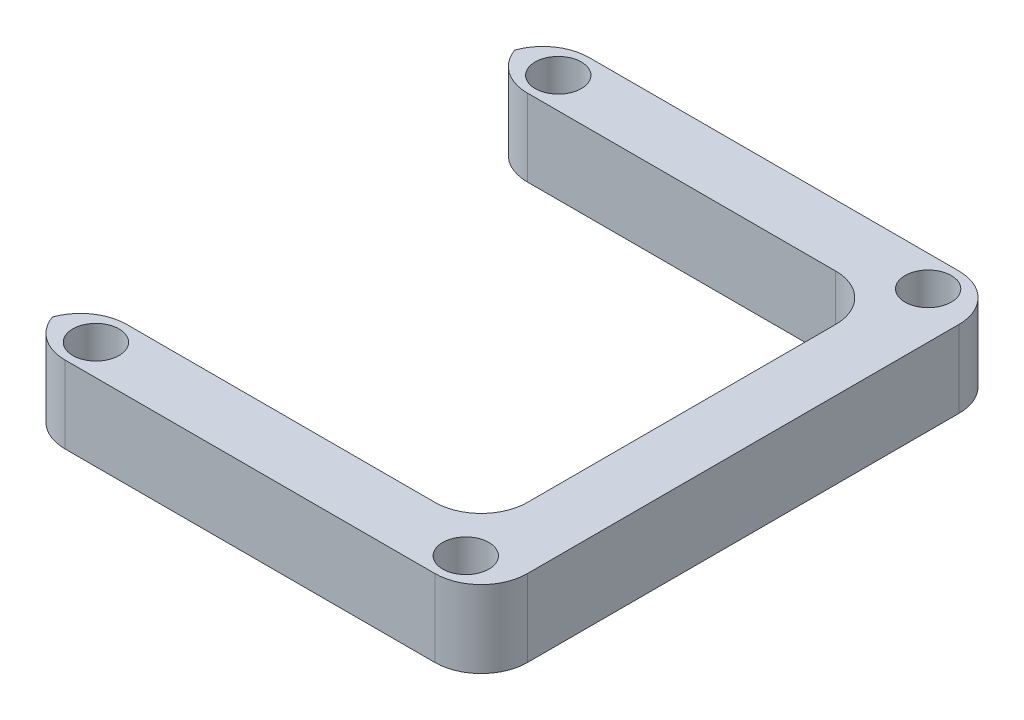
ISO-10303-21;
HEADER;
FILE_DESCRIPTION(('STEP AP214'),'2;1');
FILE_NAME('part.step','',(''),(''),'','','');
FILE_SCHEMA(('AUTOMOTIVE_DESIGN { 1 0 10303 214 1 1 1 1 }'));
ENDSEC;
DATA;
#1=APPLICATION_CONTEXT('core data for automotive mechanical design processes');
#2=APPLICATION_PROTOCOL_DEFINITION('international standard','automotive_design',2000,#1);
#3=PRODUCT_CONTEXT('',#1,'mechanical');
#4=PRODUCT('Part','Part','',(#3));
#5=PRODUCT_RELATED_PRODUCT_CATEGORY('part','',(#4));
#6=PRODUCT_DEFINITION_FORMATION('','',#4);
#7=PRODUCT_DEFINITION_CONTEXT('part definition',#1,'design');
#8=PRODUCT_DEFINITION('design','',#6,#7);
#9=PRODUCT_DEFINITION_SHAPE('','',#8);
#10=(LENGTH_UNIT() NAMED_UNIT(*) SI_UNIT(.MILLI.,.METRE.));
#11=(NAMED_UNIT(*) PLANE_ANGLE_UNIT() SI_UNIT($,.RADIAN.));
#12=(NAMED_UNIT(*) SI_UNIT($,.STERADIAN.) SOLID_ANGLE_UNIT());
#13=UNCERTAINTY_MEASURE_WITH_UNIT(LENGTH_MEASURE(1.E-05),#10,'distance_accuracy_value','');
#14=(GEOMETRIC_REPRESENTATION_CONTEXT(3) GLOBAL_UNCERTAINTY_ASSIGNED_CONTEXT((#13)) GLOBAL_UNIT_ASSIGNED_CONTEXT((#10,
#11,#12)) REPRESENTATION_CONTEXT('',''));
#15=CARTESIAN_POINT('',(0.,0.,0.));
#16=DIRECTION('',(0.,0.,1.));
#17=DIRECTION('',(1.,0.,0.));
#18=AXIS2_PLACEMENT_3D('',#15,#16,#17);
#19=CARTESIAN_POINT('',(0.,5.,-30.));
#20=DIRECTION('',(0.,0.,1.));
#21=DIRECTION('',(1.,0.,0.));
#22=AXIS2_PLACEMENT_3D('',#19,#20,#21);
#23=PLANE('',#22);
#24=DIRECTION('',(-1.,0.,0.));
#25=VECTOR('',#24,1.);
#26=CARTESIAN_POINT('',(0.,5.,-30.));
#27=LINE('',#26,#25);
#28=CARTESIAN_POINT('',(23.,5.,-30.));
#29=VERTEX_POINT('',#28);
#30=CARTESIAN_POINT('',(3.,5.,-30.));
#31=VERTEX_POINT('',#30);
#32=EDGE_CURVE('E347',#29,#31,#27,.T.);
#33=ORIENTED_EDGE('',*,*,#32,.T.);
#34=DIRECTION('',(0.,-1.,0.));
#35=VECTOR('',#34,1.);
#36=CARTESIAN_POINT('',(3.,5.,-30.));
#37=LINE('',#36,#35);
#38=CARTESIAN_POINT('',(3.,0.,-30.));
#39=VERTEX_POINT('',#38);
#40=EDGE_CURVE('E217',#31,#39,#37,.T.);
#41=ORIENTED_EDGE('',*,*,#40,.T.);
#42=DIRECTION('',(-1.,0.,0.));
#43=VECTOR('',#42,1.);
#44=CARTESIAN_POINT('',(0.,0.,-30.));
#45=LINE('',#44,#43);
#46=CARTESIAN_POINT('',(23.,0.,-30.));
#47=VERTEX_POINT('',#46);
#48=EDGE_CURVE('E299',#47,#39,#45,.T.);
#49=ORIENTED_EDGE('',*,*,#48,.F.);
#50=DIRECTION('',(0.,-1.,0.));
#51=VECTOR('',#50,1.);
#52=CARTESIAN_POINT('',(23.,5.,-30.));
#53=LINE('',#52,#51);
#54=EDGE_CURVE('E214',#47,#29,#53,.F.);
#55=ORIENTED_EDGE('',*,*,#54,.T.);
#56=EDGE_LOOP('',(#33,#41,#49,#55));
#57=FACE_BOUND('',#56,.T.);
#58=ADVANCED_FACE('F39',(#57),#23,.T.);
#59=CARTESIAN_POINT('',(26.,5.,0.));
#60=DIRECTION('',(-1.,0.,0.));
#61=DIRECTION('',(0.,0.,1.));
#62=AXIS2_PLACEMENT_3D('',#59,#60,#61);
#63=PLANE('',#62);
#64=DIRECTION('',(0.,0.,-1.));
#65=VECTOR('',#64,1.);
#66=CARTESIAN_POINT('',(26.,5.,0.));
#67=LINE('',#66,#65);
#68=CARTESIAN_POINT('',(26.,5.,-7.));
#69=VERTEX_POINT('',#68);
#70=CARTESIAN_POINT('',(26.,5.,-27.));
#71=VERTEX_POINT('',#70);
#72=EDGE_CURVE('E284',#69,#71,#67,.T.);
#73=ORIENTED_EDGE('',*,*,#72,.T.);
#74=DIRECTION('',(0.,-1.,0.));
#75=VECTOR('',#74,1.);
#76=CARTESIAN_POINT('',(26.,0.,-27.));
#77=LINE('',#76,#75);
#78=CARTESIAN_POINT('',(26.,0.,-27.));
#79=VERTEX_POINT('',#78);
#80=EDGE_CURVE('E223',#71,#79,#77,.T.);
#81=ORIENTED_EDGE('',*,*,#80,.T.);
#82=DIRECTION('',(0.,0.,-1.));
#83=VECTOR('',#82,1.);
#84=CARTESIAN_POINT('',(26.,0.,0.));
#85=LINE('',#84,#83);
#86=CARTESIAN_POINT('',(26.,0.,-7.));
#87=VERTEX_POINT('',#86);
#88=EDGE_CURVE('E302',#87,#79,#85,.T.);
#89=ORIENTED_EDGE('',*,*,#88,.F.);
#90=DIRECTION('',(0.,-1.,0.));
#91=VECTOR('',#90,1.);
#92=CARTESIAN_POINT('',(26.,5.,-7.));
#93=LINE('',#92,#91);
#94=EDGE_CURVE('E220',#87,#69,#93,.F.);
#95=ORIENTED_EDGE('',*,*,#94,.T.);
#96=EDGE_LOOP('',(#73,#81,#89,#95));
#97=FACE_BOUND('',#96,.T.);
#98=ADVANCED_FACE('F335',(#97),#63,.T.);
#99=CARTESIAN_POINT('',(0.,5.,-4.));
#100=DIRECTION('',(0.,0.,-1.));
#101=DIRECTION('',(-1.,0.,0.));
#102=AXIS2_PLACEMENT_3D('',#99,#100,#101);
#103=PLANE('',#102);
#104=DIRECTION('',(1.,0.,0.));
#105=VECTOR('',#104,1.);
#106=CARTESIAN_POINT('',(0.,5.,-4.));
#107=LINE('',#106,#105);
#108=CARTESIAN_POINT('',(3.,5.,-4.));
#109=VERTEX_POINT('',#108);
#110=CARTESIAN_POINT('',(23.,5.,-4.));
#111=VERTEX_POINT('',#110);
#112=EDGE_CURVE('E278',#109,#111,#107,.T.);
#113=ORIENTED_EDGE('',*,*,#112,.T.);
#114=DIRECTION('',(0.,-1.,0.));
#115=VECTOR('',#114,1.);
#116=CARTESIAN_POINT('',(23.,0.,-4.));
#117=LINE('',#116,#115);
#118=CARTESIAN_POINT('',(23.,0.,-4.));
#119=VERTEX_POINT('',#118);
#120=EDGE_CURVE('E231',#111,#119,#117,.T.);
#121=ORIENTED_EDGE('',*,*,#120,.T.);
#122=DIRECTION('',(1.,0.,0.));
#123=VECTOR('',#122,1.);
#124=CARTESIAN_POINT('',(0.,0.,-4.));
#125=LINE('',#124,#123);
#126=CARTESIAN_POINT('',(3.,0.,-4.));
#127=VERTEX_POINT('',#126);
#128=EDGE_CURVE('E306',#127,#119,#125,.T.);
#129=ORIENTED_EDGE('',*,*,#128,.F.);
#130=DIRECTION('',(0.,-1.,0.));
#131=VECTOR('',#130,1.);
#132=CARTESIAN_POINT('',(3.,5.,-4.));
#133=LINE('',#132,#131);
#134=EDGE_CURVE('E227',#127,#109,#133,.F.);
#135=ORIENTED_EDGE('',*,*,#134,.T.);
#136=EDGE_LOOP('',(#113,#121,#129,#135));
#137=FACE_BOUND('',#136,.T.);
#138=ADVANCED_FACE('F326',(#137),#103,.T.);
#139=CARTESIAN_POINT('',(0.,5.,0.));
#140=DIRECTION('',(0.,0.,-1.));
#141=DIRECTION('',(-1.,0.,0.));
#142=AXIS2_PLACEMENT_3D('',#139,#140,#141);
#143=PLANE('',#142);
#144=DIRECTION('',(1.,0.,0.));
#145=VECTOR('',#144,1.);
#146=CARTESIAN_POINT('',(0.,5.,0.));
#147=LINE('',#146,#145);
#148=CARTESIAN_POINT('',(3.,5.,0.));
#149=VERTEX_POINT('',#148);
#150=CARTESIAN_POINT('',(27.,5.,0.));
#151=VERTEX_POINT('',#150);
#152=EDGE_CURVE('E270',#149,#151,#147,.T.);
#153=ORIENTED_EDGE('',*,*,#152,.F.);
#154=DIRECTION('',(0.,-1.,0.));
#155=VECTOR('',#154,1.);
#156=CARTESIAN_POINT('',(3.,0.,0.));
#157=LINE('',#156,#155);
#158=CARTESIAN_POINT('',(3.,0.,0.));
#159=VERTEX_POINT('',#158);
#160=EDGE_CURVE('E238',#149,#159,#157,.T.);
#161=ORIENTED_EDGE('',*,*,#160,.T.);
#162=DIRECTION('',(1.,0.,0.));
#163=VECTOR('',#162,1.);
#164=CARTESIAN_POINT('',(0.,0.,0.));
#165=LINE('',#164,#163);
#166=CARTESIAN_POINT('',(27.,0.,0.));
#167=VERTEX_POINT('',#166);
#168=EDGE_CURVE('E310',#159,#167,#165,.T.);
#169=ORIENTED_EDGE('',*,*,#168,.T.);
#170=DIRECTION('',(0.,-1.,0.));
#171=VECTOR('',#170,1.);
#172=CARTESIAN_POINT('',(27.,5.,0.));
#173=LINE('',#172,#171);
#174=EDGE_CURVE('E235',#167,#151,#173,.F.);
#175=ORIENTED_EDGE('',*,*,#174,.T.);
#176=EDGE_LOOP('',(#153,#161,#169,#175));
#177=FACE_BOUND('',#176,.T.);
#178=ADVANCED_FACE('F273',(#177),#143,.F.);
#179=CARTESIAN_POINT('',(30.,5.,0.));
#180=DIRECTION('',(-1.,0.,0.));
#181=DIRECTION('',(0.,0.,1.));
#182=AXIS2_PLACEMENT_3D('',#179,#180,#181);
#183=PLANE('',#182);
#184=DIRECTION('',(0.,0.,-1.));
#185=VECTOR('',#184,1.);
#186=CARTESIAN_POINT('',(30.,0.,0.));
#187=LINE('',#186,#185);
#188=CARTESIAN_POINT('',(30.,0.,-3.));
#189=VERTEX_POINT('',#188);
#190=CARTESIAN_POINT('',(30.,0.,-31.));
#191=VERTEX_POINT('',#190);
#192=EDGE_CURVE('E165',#189,#191,#187,.T.);
#193=ORIENTED_EDGE('',*,*,#192,.T.);
#194=DIRECTION('',(0.,-1.,0.));
#195=VECTOR('',#194,1.);
#196=CARTESIAN_POINT('',(30.,5.,-31.));
#197=LINE('',#196,#195);
#198=CARTESIAN_POINT('',(30.,5.,-31.));
#199=VERTEX_POINT('',#198);
#200=EDGE_CURVE('E195',#191,#199,#197,.F.);
#201=ORIENTED_EDGE('',*,*,#200,.T.);
#202=DIRECTION('',(0.,0.,-1.));
#203=VECTOR('',#202,1.);
#204=CARTESIAN_POINT('',(30.,5.,0.));
#205=LINE('',#204,#203);
#206=CARTESIAN_POINT('',(30.,5.,-3.));
#207=VERTEX_POINT('',#206);
#208=EDGE_CURVE('E175',#207,#199,#205,.T.);
#209=ORIENTED_EDGE('',*,*,#208,.F.);
#210=DIRECTION('',(0.,-1.,0.));
#211=VECTOR('',#210,1.);
#212=CARTESIAN_POINT('',(30.,5.,-3.));
#213=LINE('',#212,#211);
#214=EDGE_CURVE('E191',#207,#189,#213,.T.);
#215=ORIENTED_EDGE('',*,*,#214,.T.);
#216=EDGE_LOOP('',(#193,#201,#209,#215));
#217=FACE_BOUND('',#216,.T.);
#218=ADVANCED_FACE('F317',(#217),#183,.F.);
#219=CARTESIAN_POINT('',(3.,5.,-2.));
#220=DIRECTION('',(0.,-1.,0.));
#221=DIRECTION('',(0.,0.,-1.));
#222=AXIS2_PLACEMENT_3D('',#219,#220,#221);
#223=CYLINDRICAL_SURFACE('',#222,1.5);
#224=CARTESIAN_POINT('',(3.,5.,-2.));
#225=DIRECTION('',(0.,1.,0.));
#226=DIRECTION('',(0.,0.,1.));
#227=AXIS2_PLACEMENT_3D('',#224,#225,#226);
#228=CIRCLE('',#227,1.5);
#229=CARTESIAN_POINT('',(3.,5.,-0.5));
#230=VERTEX_POINT('',#229);
#231=EDGE_CURVE('E351',#230,#230,#228,.T.);
#232=ORIENTED_EDGE('',*,*,#231,.T.);
#233=EDGE_LOOP('',(#232));
#234=FACE_BOUND('',#233,.T.);
#235=CARTESIAN_POINT('',(3.,0.,-2.));
#236=DIRECTION('',(0.,1.,0.));
#237=DIRECTION('',(0.,0.,1.));
#238=AXIS2_PLACEMENT_3D('',#235,#236,#237);
#239=CIRCLE('',#238,1.5);
#240=CARTESIAN_POINT('',(3.,0.,-0.5));
#241=VERTEX_POINT('',#240);
#242=EDGE_CURVE('E295',#241,#241,#239,.T.);
#243=ORIENTED_EDGE('',*,*,#242,.F.);
#244=EDGE_LOOP('',(#243));
#245=FACE_BOUND('',#244,.T.);
#246=ADVANCED_FACE('F382',(#234,#245),#223,.F.);
#247=CARTESIAN_POINT('',(3.,5.,-32.));
#248=DIRECTION('',(0.,-1.,0.));
#249=DIRECTION('',(0.,0.,-1.));
#250=AXIS2_PLACEMENT_3D('',#247,#248,#249);
#251=CYLINDRICAL_SURFACE('',#250,1.5);
#252=CARTESIAN_POINT('',(3.,5.,-32.));
#253=DIRECTION('',(0.,1.,0.));
#254=DIRECTION('',(0.,0.,1.));
#255=AXIS2_PLACEMENT_3D('',#252,#253,#254);
#256=CIRCLE('',#255,1.5);
#257=CARTESIAN_POINT('',(3.,5.,-30.5));
#258=VERTEX_POINT('',#257);
#259=EDGE_CURVE('E356',#258,#258,#256,.T.);
#260=ORIENTED_EDGE('',*,*,#259,.T.);
#261=EDGE_LOOP('',(#260));
#262=FACE_BOUND('',#261,.T.);
#263=CARTESIAN_POINT('',(3.,0.,-32.));
#264=DIRECTION('',(0.,1.,0.));
#265=DIRECTION('',(0.,0.,1.));
#266=AXIS2_PLACEMENT_3D('',#263,#264,#265);
#267=CIRCLE('',#266,1.5);
#268=CARTESIAN_POINT('',(3.,0.,-30.5));
#269=VERTEX_POINT('',#268);
#270=EDGE_CURVE('E291',#269,#269,#267,.T.);
#271=ORIENTED_EDGE('',*,*,#270,.F.);
#272=EDGE_LOOP('',(#271));
#273=FACE_BOUND('',#272,.T.);
#274=ADVANCED_FACE('F385',(#262,#273),#251,.F.);
#275=CARTESIAN_POINT('',(27.,5.,-32.));
#276=DIRECTION('',(0.,-1.,0.));
#277=DIRECTION('',(0.,0.,-1.));
#278=AXIS2_PLACEMENT_3D('',#275,#276,#277);
#279=CYLINDRICAL_SURFACE('',#278,1.5);
#280=CARTESIAN_POINT('',(27.,5.,-32.));
#281=DIRECTION('',(0.,1.,0.));
#282=DIRECTION('',(0.,0.,1.));
#283=AXIS2_PLACEMENT_3D('',#280,#281,#282);
#284=CIRCLE('',#283,1.5);
#285=CARTESIAN_POINT('',(27.,5.,-30.5));
#286=VERTEX_POINT('',#285);
#287=EDGE_CURVE('E362',#286,#286,#284,.T.);
#288=ORIENTED_EDGE('',*,*,#287,.T.);
#289=EDGE_LOOP('',(#288));
#290=FACE_BOUND('',#289,.T.);
#291=CARTESIAN_POINT('',(27.,0.,-32.));
#292=DIRECTION('',(0.,1.,0.));
#293=DIRECTION('',(0.,0.,1.));
#294=AXIS2_PLACEMENT_3D('',#291,#292,#293);
#295=CIRCLE('',#294,1.5);
#296=CARTESIAN_POINT('',(27.,0.,-30.5));
#297=VERTEX_POINT('',#296);
#298=EDGE_CURVE('E254',#297,#297,#295,.T.);
#299=ORIENTED_EDGE('',*,*,#298,.F.);
#300=EDGE_LOOP('',(#299));
#301=FACE_BOUND('',#300,.T.);
#302=ADVANCED_FACE('F408',(#290,#301),#279,.F.);
#303=CARTESIAN_POINT('',(27.,5.,-2.));
#304=DIRECTION('',(0.,-1.,0.));
#305=DIRECTION('',(0.,0.,-1.));
#306=AXIS2_PLACEMENT_3D('',#303,#304,#305);
#307=CYLINDRICAL_SURFACE('',#306,1.5);
#308=CARTESIAN_POINT('',(27.,5.,-2.));
#309=DIRECTION('',(0.,1.,0.));
#310=DIRECTION('',(0.,0.,1.));
#311=AXIS2_PLACEMENT_3D('',#308,#309,#310);
#312=CIRCLE('',#311,1.5);
#313=CARTESIAN_POINT('',(27.,5.,-0.499999999999999));
#314=VERTEX_POINT('',#313);
#315=EDGE_CURVE('E164',#314,#314,#312,.T.);
#316=ORIENTED_EDGE('',*,*,#315,.T.);
#317=EDGE_LOOP('',(#316));
#318=FACE_BOUND('',#317,.T.);
#319=CARTESIAN_POINT('',(27.,0.,-2.));
#320=DIRECTION('',(0.,1.,0.));
#321=DIRECTION('',(0.,0.,1.));
#322=AXIS2_PLACEMENT_3D('',#319,#320,#321);
#323=CIRCLE('',#322,1.5);
#324=CARTESIAN_POINT('',(27.,0.,-0.499999999999999));
#325=VERTEX_POINT('',#324);
#326=EDGE_CURVE('E250',#325,#325,#323,.T.);
#327=ORIENTED_EDGE('',*,*,#326,.F.);
#328=EDGE_LOOP('',(#327));
#329=FACE_BOUND('',#328,.T.);
#330=ADVANCED_FACE('F370',(#318,#329),#307,.F.);
#331=CARTESIAN_POINT('',(0.,5.,-34.));
#332=DIRECTION('',(0.,0.,-1.));
#333=DIRECTION('',(-1.,0.,0.));
#334=AXIS2_PLACEMENT_3D('',#331,#332,#333);
#335=PLANE('',#334);
#336=DIRECTION('',(1.,0.,0.));
#337=VECTOR('',#336,1.);
#338=CARTESIAN_POINT('',(0.,5.,-34.));
#339=LINE('',#338,#337);
#340=CARTESIAN_POINT('',(3.,5.,-34.));
#341=VERTEX_POINT('',#340);
#342=CARTESIAN_POINT('',(27.,5.,-34.));
#343=VERTEX_POINT('',#342);
#344=EDGE_CURVE('E169',#341,#343,#339,.T.);
#345=ORIENTED_EDGE('',*,*,#344,.T.);
#346=DIRECTION('',(0.,-1.,0.));
#347=VECTOR('',#346,1.);
#348=CARTESIAN_POINT('',(27.,0.,-34.));
#349=LINE('',#348,#347);
#350=CARTESIAN_POINT('',(27.,0.,-34.));
#351=VERTEX_POINT('',#350);
#352=EDGE_CURVE('E162',#343,#351,#349,.T.);
#353=ORIENTED_EDGE('',*,*,#352,.T.);
#354=DIRECTION('',(1.,0.,0.));
#355=VECTOR('',#354,1.);
#356=CARTESIAN_POINT('',(0.,0.,-34.));
#357=LINE('',#356,#355);
#358=CARTESIAN_POINT('',(3.,0.,-34.));
#359=VERTEX_POINT('',#358);
#360=EDGE_CURVE('E144',#359,#351,#357,.T.);
#361=ORIENTED_EDGE('',*,*,#360,.F.);
#362=DIRECTION('',(0.,-1.,0.));
#363=VECTOR('',#362,1.);
#364=CARTESIAN_POINT('',(3.,5.,-34.));
#365=LINE('',#364,#363);
#366=EDGE_CURVE('E160',#359,#341,#365,.F.);
#367=ORIENTED_EDGE('',*,*,#366,.T.);
#368=EDGE_LOOP('',(#345,#353,#361,#367));
#369=FACE_BOUND('',#368,.T.);
#370=ADVANCED_FACE('F159',(#369),#335,.T.);
#371=CARTESIAN_POINT('',(0.,5.,0.));
#372=DIRECTION('',(0.,1.,0.));
#373=DIRECTION('',(0.,0.,1.));
#374=AXIS2_PLACEMENT_3D('',#371,#372,#373);
#375=PLANE('',#374);
#376=ORIENTED_EDGE('',*,*,#315,.F.);
#377=EDGE_LOOP('',(#376));
#378=FACE_BOUND('',#377,.T.);
#379=ORIENTED_EDGE('',*,*,#287,.F.);
#380=EDGE_LOOP('',(#379));
#381=FACE_BOUND('',#380,.T.);
#382=ORIENTED_EDGE('',*,*,#259,.F.);
#383=EDGE_LOOP('',(#382));
#384=FACE_BOUND('',#383,.T.);
#385=ORIENTED_EDGE('',*,*,#231,.F.);
#386=EDGE_LOOP('',(#385));
#387=FACE_BOUND('',#386,.T.);
#388=ORIENTED_EDGE('',*,*,#208,.T.);
#389=CARTESIAN_POINT('',(27.,5.,-31.));
#390=DIRECTION('',(0.,1.,0.));
#391=DIRECTION('',(0.,0.,1.));
#392=AXIS2_PLACEMENT_3D('',#389,#390,#391);
#393=CIRCLE('',#392,3.);
#394=EDGE_CURVE('E211',#199,#343,#393,.T.);
#395=ORIENTED_EDGE('',*,*,#394,.T.);
#396=ORIENTED_EDGE('',*,*,#344,.F.);
#397=CARTESIAN_POINT('',(3.,5.,-31.));
#398=DIRECTION('',(0.,1.,0.));
#399=DIRECTION('',(0.,0.,1.));
#400=AXIS2_PLACEMENT_3D('',#397,#398,#399);
#401=CIRCLE('',#400,3.);
#402=CARTESIAN_POINT('',(0.171572875253809,5.,-32.));
#403=VERTEX_POINT('',#402);
#404=EDGE_CURVE('E57',#341,#403,#401,.T.);
#405=ORIENTED_EDGE('',*,*,#404,.T.);
#406=CARTESIAN_POINT('',(3.,5.,-33.));
#407=DIRECTION('',(0.,1.,0.));
#408=DIRECTION('',(0.,0.,1.));
#409=AXIS2_PLACEMENT_3D('',#406,#407,#408);
#410=CIRCLE('',#409,3.);
#411=EDGE_CURVE('E206',#403,#31,#410,.T.);
#412=ORIENTED_EDGE('',*,*,#411,.T.);
#413=ORIENTED_EDGE('',*,*,#32,.F.);
#414=CARTESIAN_POINT('',(23.,5.,-27.));
#415=DIRECTION('',(0.,1.,0.));
#416=DIRECTION('',(0.,0.,1.));
#417=AXIS2_PLACEMENT_3D('',#414,#415,#416);
#418=CIRCLE('',#417,3.);
#419=EDGE_CURVE('E244',#29,#71,#418,.F.);
#420=ORIENTED_EDGE('',*,*,#419,.T.);
#421=ORIENTED_EDGE('',*,*,#72,.F.);
#422=CARTESIAN_POINT('',(23.,5.,-7.));
#423=DIRECTION('',(0.,1.,0.));
#424=DIRECTION('',(0.,0.,1.));
#425=AXIS2_PLACEMENT_3D('',#422,#423,#424);
#426=CIRCLE('',#425,3.);
#427=EDGE_CURVE('E11',#69,#111,#426,.F.);
#428=ORIENTED_EDGE('',*,*,#427,.T.);
#429=ORIENTED_EDGE('',*,*,#112,.F.);
#430=CARTESIAN_POINT('',(3.,5.,-1.));
#431=DIRECTION('',(0.,1.,0.));
#432=DIRECTION('',(0.,0.,1.));
#433=AXIS2_PLACEMENT_3D('',#430,#431,#432);
#434=CIRCLE('',#433,3.);
#435=CARTESIAN_POINT('',(0.17157287525381,5.,-2.));
#436=VERTEX_POINT('',#435);
#437=EDGE_CURVE('E64',#109,#436,#434,.T.);
#438=ORIENTED_EDGE('',*,*,#437,.T.);
#439=CARTESIAN_POINT('',(3.,5.,-3.));
#440=DIRECTION('',(0.,1.,0.));
#441=DIRECTION('',(0.,0.,1.));
#442=AXIS2_PLACEMENT_3D('',#439,#440,#441);
#443=CIRCLE('',#442,3.);
#444=EDGE_CURVE('E201',#436,#149,#443,.T.);
#445=ORIENTED_EDGE('',*,*,#444,.T.);
#446=ORIENTED_EDGE('',*,*,#152,.T.);
#447=CARTESIAN_POINT('',(27.,5.,-3.));
#448=DIRECTION('',(0.,1.,0.));
#449=DIRECTION('',(0.,0.,1.));
#450=AXIS2_PLACEMENT_3D('',#447,#448,#449);
#451=CIRCLE('',#450,3.);
#452=EDGE_CURVE('E198',#151,#207,#451,.T.);
#453=ORIENTED_EDGE('',*,*,#452,.T.);
#454=EDGE_LOOP('',(#388,#395,#396,#405,#412,#413,#420,#421,#428,#429,#438,#445,#446,#453));
#455=FACE_BOUND('',#454,.T.);
#456=ADVANCED_FACE('F269',(#378,#381,#384,#387,#455),#375,.T.);
#457=CARTESIAN_POINT('',(0.,0.,0.));
#458=DIRECTION('',(0.,1.,0.));
#459=DIRECTION('',(0.,0.,1.));
#460=AXIS2_PLACEMENT_3D('',#457,#458,#459);
#461=PLANE('',#460);
#462=ORIENTED_EDGE('',*,*,#326,.T.);
#463=EDGE_LOOP('',(#462));
#464=FACE_BOUND('',#463,.T.);
#465=ORIENTED_EDGE('',*,*,#298,.T.);
#466=EDGE_LOOP('',(#465));
#467=FACE_BOUND('',#466,.T.);
#468=ORIENTED_EDGE('',*,*,#270,.T.);
#469=EDGE_LOOP('',(#468));
#470=FACE_BOUND('',#469,.T.);
#471=ORIENTED_EDGE('',*,*,#242,.T.);
#472=EDGE_LOOP('',(#471));
#473=FACE_BOUND('',#472,.T.);
#474=ORIENTED_EDGE('',*,*,#360,.T.);
#475=CARTESIAN_POINT('',(27.,0.,-31.));
#476=DIRECTION('',(0.,1.,0.));
#477=DIRECTION('',(0.,0.,1.));
#478=AXIS2_PLACEMENT_3D('',#475,#476,#477);
#479=CIRCLE('',#478,3.);
#480=EDGE_CURVE('E153',#351,#191,#479,.F.);
#481=ORIENTED_EDGE('',*,*,#480,.T.);
#482=ORIENTED_EDGE('',*,*,#192,.F.);
#483=CARTESIAN_POINT('',(27.,0.,-3.));
#484=DIRECTION('',(0.,1.,0.));
#485=DIRECTION('',(0.,0.,1.));
#486=AXIS2_PLACEMENT_3D('',#483,#484,#485);
#487=CIRCLE('',#486,3.);
#488=EDGE_CURVE('E173',#189,#167,#487,.F.);
#489=ORIENTED_EDGE('',*,*,#488,.T.);
#490=ORIENTED_EDGE('',*,*,#168,.F.);
#491=CARTESIAN_POINT('',(3.,0.,-3.));
#492=DIRECTION('',(0.,1.,0.));
#493=DIRECTION('',(0.,0.,1.));
#494=AXIS2_PLACEMENT_3D('',#491,#492,#493);
#495=CIRCLE('',#494,3.);
#496=CARTESIAN_POINT('',(0.17157287525381,0.,-2.));
#497=VERTEX_POINT('',#496);
#498=EDGE_CURVE('E181',#159,#497,#495,.F.);
#499=ORIENTED_EDGE('',*,*,#498,.T.);
#500=CARTESIAN_POINT('',(3.,0.,-1.));
#501=DIRECTION('',(0.,1.,0.));
#502=DIRECTION('',(0.,0.,1.));
#503=AXIS2_PLACEMENT_3D('',#500,#501,#502);
#504=CIRCLE('',#503,3.);
#505=EDGE_CURVE('E184',#497,#127,#504,.F.);
#506=ORIENTED_EDGE('',*,*,#505,.T.);
#507=ORIENTED_EDGE('',*,*,#128,.T.);
#508=CARTESIAN_POINT('',(23.,0.,-7.));
#509=DIRECTION('',(0.,1.,0.));
#510=DIRECTION('',(0.,0.,1.));
#511=AXIS2_PLACEMENT_3D('',#508,#509,#510);
#512=CIRCLE('',#511,3.);
#513=EDGE_CURVE('E49',#119,#87,#512,.T.);
#514=ORIENTED_EDGE('',*,*,#513,.T.);
#515=ORIENTED_EDGE('',*,*,#88,.T.);
#516=CARTESIAN_POINT('',(23.,0.,-27.));
#517=DIRECTION('',(0.,1.,0.));
#518=DIRECTION('',(0.,0.,1.));
#519=AXIS2_PLACEMENT_3D('',#516,#517,#518);
#520=CIRCLE('',#519,3.);
#521=EDGE_CURVE('E241',#79,#47,#520,.T.);
#522=ORIENTED_EDGE('',*,*,#521,.T.);
#523=ORIENTED_EDGE('',*,*,#48,.T.);
#524=CARTESIAN_POINT('',(3.,0.,-33.));
#525=DIRECTION('',(0.,1.,0.));
#526=DIRECTION('',(0.,0.,1.));
#527=AXIS2_PLACEMENT_3D('',#524,#525,#526);
#528=CIRCLE('',#527,3.);
#529=CARTESIAN_POINT('',(0.171572875253809,0.,-32.));
#530=VERTEX_POINT('',#529);
#531=EDGE_CURVE('E147',#39,#530,#528,.F.);
#532=ORIENTED_EDGE('',*,*,#531,.T.);
#533=CARTESIAN_POINT('',(3.,0.,-31.));
#534=DIRECTION('',(0.,1.,0.));
#535=DIRECTION('',(0.,0.,1.));
#536=AXIS2_PLACEMENT_3D('',#533,#534,#535);
#537=CIRCLE('',#536,3.);
#538=EDGE_CURVE('E141',#530,#359,#537,.F.);
#539=ORIENTED_EDGE('',*,*,#538,.T.);
#540=EDGE_LOOP('',(#474,#481,#482,#489,#490,#499,#506,#507,#514,#515,#522,#523,#532,#539));
#541=FACE_BOUND('',#540,.T.);
#542=ADVANCED_FACE('F143',(#464,#467,#470,#473,#541),#461,.F.);
#543=CARTESIAN_POINT('',(27.,5.,-31.));
#544=DIRECTION('',(0.,1.,0.));
#545=DIRECTION('',(0.,0.,1.));
#546=AXIS2_PLACEMENT_3D('',#543,#544,#545);
#547=CYLINDRICAL_SURFACE('',#546,3.);
#548=ORIENTED_EDGE('',*,*,#394,.F.);
#549=ORIENTED_EDGE('',*,*,#200,.F.);
#550=ORIENTED_EDGE('',*,*,#480,.F.);
#551=ORIENTED_EDGE('',*,*,#352,.F.);
#552=EDGE_LOOP('',(#548,#549,#550,#551));
#553=FACE_BOUND('',#552,.T.);
#554=ADVANCED_FACE('F322',(#553),#547,.T.);
#555=CARTESIAN_POINT('',(3.,5.,-33.));
#556=DIRECTION('',(0.,-1.,0.));
#557=DIRECTION('',(0.,0.,-1.));
#558=AXIS2_PLACEMENT_3D('',#555,#556,#557);
#559=CYLINDRICAL_SURFACE('',#558,3.);
#560=ORIENTED_EDGE('',*,*,#40,.F.);
#561=ORIENTED_EDGE('',*,*,#411,.F.);
#562=DIRECTION('',(0.,-1.,0.));
#563=VECTOR('',#562,1.);
#564=CARTESIAN_POINT('',(0.17157287525381,2.5,-32.));
#565=LINE('',#564,#563);
#566=EDGE_CURVE('E248',#530,#403,#565,.F.);
#567=ORIENTED_EDGE('',*,*,#566,.F.);
#568=ORIENTED_EDGE('',*,*,#531,.F.);
#569=EDGE_LOOP('',(#560,#561,#567,#568));
#570=FACE_BOUND('',#569,.T.);
#571=ADVANCED_FACE('F349',(#570),#559,.T.);
#572=CARTESIAN_POINT('',(3.,5.,-31.));
#573=DIRECTION('',(0.,-1.,0.));
#574=DIRECTION('',(0.,0.,-1.));
#575=AXIS2_PLACEMENT_3D('',#572,#573,#574);
#576=CYLINDRICAL_SURFACE('',#575,3.);
#577=ORIENTED_EDGE('',*,*,#404,.F.);
#578=ORIENTED_EDGE('',*,*,#366,.F.);
#579=ORIENTED_EDGE('',*,*,#538,.F.);
#580=ORIENTED_EDGE('',*,*,#566,.T.);
#581=EDGE_LOOP('',(#577,#578,#579,#580));
#582=FACE_BOUND('',#581,.T.);
#583=ADVANCED_FACE('F167',(#582),#576,.T.);
#584=CARTESIAN_POINT('',(23.,5.,-27.));
#585=DIRECTION('',(0.,1.,0.));
#586=DIRECTION('',(0.,0.,1.));
#587=AXIS2_PLACEMENT_3D('',#584,#585,#586);
#588=CYLINDRICAL_SURFACE('',#587,3.);
#589=ORIENTED_EDGE('',*,*,#419,.F.);
#590=ORIENTED_EDGE('',*,*,#54,.F.);
#591=ORIENTED_EDGE('',*,*,#521,.F.);
#592=ORIENTED_EDGE('',*,*,#80,.F.);
#593=EDGE_LOOP('',(#589,#590,#591,#592));
#594=FACE_BOUND('',#593,.T.);
#595=ADVANCED_FACE('F340',(#594),#588,.F.);
#596=CARTESIAN_POINT('',(23.,5.,-7.));
#597=DIRECTION('',(0.,1.,0.));
#598=DIRECTION('',(0.,0.,1.));
#599=AXIS2_PLACEMENT_3D('',#596,#597,#598);
#600=CYLINDRICAL_SURFACE('',#599,3.);
#601=ORIENTED_EDGE('',*,*,#427,.F.);
#602=ORIENTED_EDGE('',*,*,#94,.F.);
#603=ORIENTED_EDGE('',*,*,#513,.F.);
#604=ORIENTED_EDGE('',*,*,#120,.F.);
#605=EDGE_LOOP('',(#601,#602,#603,#604));
#606=FACE_BOUND('',#605,.T.);
#607=ADVANCED_FACE('F330',(#606),#600,.F.);
#608=CARTESIAN_POINT('',(3.,5.,-3.));
#609=DIRECTION('',(0.,1.,0.));
#610=DIRECTION('',(0.,0.,1.));
#611=AXIS2_PLACEMENT_3D('',#608,#609,#610);
#612=CYLINDRICAL_SURFACE('',#611,3.);
#613=ORIENTED_EDGE('',*,*,#160,.F.);
#614=ORIENTED_EDGE('',*,*,#444,.F.);
#615=DIRECTION('',(0.,1.,0.));
#616=VECTOR('',#615,1.);
#617=CARTESIAN_POINT('',(0.17157287525381,2.5,-2.));
#618=LINE('',#617,#616);
#619=EDGE_CURVE('E43',#497,#436,#618,.T.);
#620=ORIENTED_EDGE('',*,*,#619,.F.);
#621=ORIENTED_EDGE('',*,*,#498,.F.);
#622=EDGE_LOOP('',(#613,#614,#620,#621));
#623=FACE_BOUND('',#622,.T.);
#624=ADVANCED_FACE('F265',(#623),#612,.T.);
#625=CARTESIAN_POINT('',(3.,5.,-1.));
#626=DIRECTION('',(0.,-1.,0.));
#627=DIRECTION('',(0.,0.,-1.));
#628=AXIS2_PLACEMENT_3D('',#625,#626,#627);
#629=CYLINDRICAL_SURFACE('',#628,3.);
#630=ORIENTED_EDGE('',*,*,#437,.F.);
#631=ORIENTED_EDGE('',*,*,#134,.F.);
#632=ORIENTED_EDGE('',*,*,#505,.F.);
#633=ORIENTED_EDGE('',*,*,#619,.T.);
#634=EDGE_LOOP('',(#630,#631,#632,#633));
#635=FACE_BOUND('',#634,.T.);
#636=ADVANCED_FACE('F260',(#635),#629,.T.);
#637=CARTESIAN_POINT('',(27.,5.,-3.));
#638=DIRECTION('',(0.,-1.,0.));
#639=DIRECTION('',(0.,0.,-1.));
#640=AXIS2_PLACEMENT_3D('',#637,#638,#639);
#641=CYLINDRICAL_SURFACE('',#640,3.);
#642=ORIENTED_EDGE('',*,*,#452,.F.);
#643=ORIENTED_EDGE('',*,*,#174,.F.);
#644=ORIENTED_EDGE('',*,*,#488,.F.);
#645=ORIENTED_EDGE('',*,*,#214,.F.);
#646=EDGE_LOOP('',(#642,#643,#644,#645));
#647=FACE_BOUND('',#646,.T.);
#648=ADVANCED_FACE('F41',(#647),#641,.T.);
#649=CLOSED_SHELL('',(#58,#98,#138,#178,#218,#246,#274,#302,#330,#370,#456,#542,#554,#571,#583,
#595,#607,#624,#636,#648));
#650=MANIFOLD_SOLID_BREP('B2',#649);
#651=ADVANCED_BREP_SHAPE_REPRESENTATION('',(#18,#650),#14);
#652=SHAPE_DEFINITION_REPRESENTATION(#9,#651);
ENDSEC;
END-ISO-10303-21;
